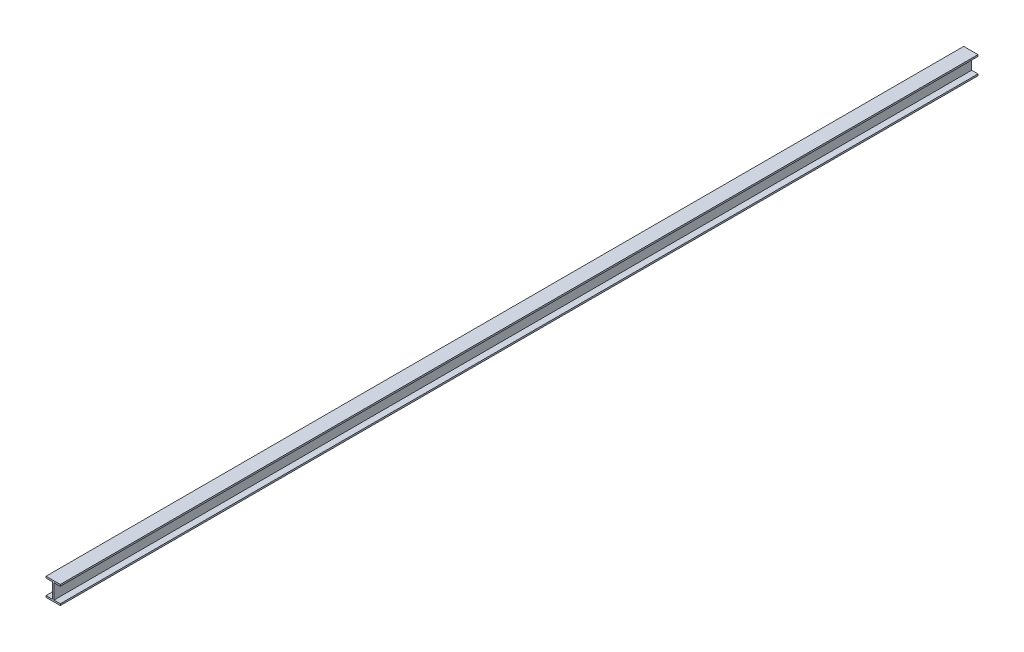
ISO-10303-21;
HEADER;
FILE_DESCRIPTION(('STEP AP214'),'2;1');
FILE_NAME('part.step','',(''),(''),'','','');
FILE_SCHEMA(('AUTOMOTIVE_DESIGN { 1 0 10303 214 1 1 1 1 }'));
ENDSEC;
DATA;
#1=APPLICATION_CONTEXT('core data for automotive mechanical design processes');
#2=APPLICATION_PROTOCOL_DEFINITION('international standard','automotive_design',2000,#1);
#3=PRODUCT_CONTEXT('',#1,'mechanical');
#4=PRODUCT('Part','Part','',(#3));
#5=PRODUCT_RELATED_PRODUCT_CATEGORY('part','',(#4));
#6=PRODUCT_DEFINITION_FORMATION('','',#4);
#7=PRODUCT_DEFINITION_CONTEXT('part definition',#1,'design');
#8=PRODUCT_DEFINITION('design','',#6,#7);
#9=PRODUCT_DEFINITION_SHAPE('','',#8);
#10=(LENGTH_UNIT() NAMED_UNIT(*) SI_UNIT(.MILLI.,.METRE.));
#11=(NAMED_UNIT(*) PLANE_ANGLE_UNIT() SI_UNIT($,.RADIAN.));
#12=(NAMED_UNIT(*) SI_UNIT($,.STERADIAN.) SOLID_ANGLE_UNIT());
#13=UNCERTAINTY_MEASURE_WITH_UNIT(LENGTH_MEASURE(1.E-05),#10,'distance_accuracy_value','');
#14=(GEOMETRIC_REPRESENTATION_CONTEXT(3) GLOBAL_UNCERTAINTY_ASSIGNED_CONTEXT((#13)) GLOBAL_UNIT_ASSIGNED_CONTEXT((#10,
#11,#12)) REPRESENTATION_CONTEXT('',''));
#15=CARTESIAN_POINT('',(0.,0.,0.));
#16=DIRECTION('',(0.,0.,1.));
#17=DIRECTION('',(1.,0.,0.));
#18=AXIS2_PLACEMENT_3D('',#15,#16,#17);
#19=CARTESIAN_POINT('',(0.,-328.,18000.));
#20=DIRECTION('',(0.,1.,0.));
#21=DIRECTION('',(0.,0.,1.));
#22=AXIS2_PLACEMENT_3D('',#19,#20,#21);
#23=PLANE('',#22);
#24=DIRECTION('',(1.,0.,0.));
#25=VECTOR('',#24,1.);
#26=CARTESIAN_POINT('',(0.,-328.,0.));
#27=LINE('',#26,#25);
#28=CARTESIAN_POINT('',(156.,-328.,0.));
#29=VERTEX_POINT('',#28);
#30=CARTESIAN_POINT('',(280.,-328.,0.));
#31=VERTEX_POINT('',#30);
#32=EDGE_CURVE('E164',#29,#31,#27,.T.);
#33=ORIENTED_EDGE('',*,*,#32,.F.);
#34=DIRECTION('',(0.,0.,-1.));
#35=VECTOR('',#34,1.);
#36=CARTESIAN_POINT('',(156.,-328.,18000.));
#37=LINE('',#36,#35);
#38=CARTESIAN_POINT('',(156.,-328.,18000.));
#39=VERTEX_POINT('',#38);
#40=EDGE_CURVE('E11',#39,#29,#37,.T.);
#41=ORIENTED_EDGE('',*,*,#40,.F.);
#42=DIRECTION('',(1.,0.,0.));
#43=VECTOR('',#42,1.);
#44=CARTESIAN_POINT('',(0.,-328.,18000.));
#45=LINE('',#44,#43);
#46=CARTESIAN_POINT('',(280.,-328.,18000.));
#47=VERTEX_POINT('',#46);
#48=EDGE_CURVE('E205',#39,#47,#45,.T.);
#49=ORIENTED_EDGE('',*,*,#48,.T.);
#50=DIRECTION('',(0.,0.,-1.));
#51=VECTOR('',#50,1.);
#52=CARTESIAN_POINT('',(280.,-328.,18000.));
#53=LINE('',#52,#51);
#54=EDGE_CURVE('E104',#47,#31,#53,.T.);
#55=ORIENTED_EDGE('',*,*,#54,.T.);
#56=EDGE_LOOP('',(#33,#41,#49,#55));
#57=FACE_BOUND('',#56,.T.);
#58=ADVANCED_FACE('F41',(#57),#23,.T.);
#59=CARTESIAN_POINT('',(156.,0.,18000.));
#60=DIRECTION('',(1.,0.,0.));
#61=DIRECTION('',(0.,1.,0.));
#62=AXIS2_PLACEMENT_3D('',#59,#60,#61);
#63=PLANE('',#62);
#64=DIRECTION('',(0.,-1.,0.));
#65=VECTOR('',#64,1.);
#66=CARTESIAN_POINT('',(156.,0.,0.));
#67=LINE('',#66,#65);
#68=CARTESIAN_POINT('',(156.,-32.,0.));
#69=VERTEX_POINT('',#68);
#70=EDGE_CURVE('E168',#69,#29,#67,.T.);
#71=ORIENTED_EDGE('',*,*,#70,.F.);
#72=DIRECTION('',(0.,0.,-1.));
#73=VECTOR('',#72,1.);
#74=CARTESIAN_POINT('',(156.,-32.,18000.));
#75=LINE('',#74,#73);
#76=CARTESIAN_POINT('',(156.,-32.,18000.));
#77=VERTEX_POINT('',#76);
#78=EDGE_CURVE('E50',#77,#69,#75,.T.);
#79=ORIENTED_EDGE('',*,*,#78,.F.);
#80=DIRECTION('',(0.,-1.,0.));
#81=VECTOR('',#80,1.);
#82=CARTESIAN_POINT('',(156.,0.,18000.));
#83=LINE('',#82,#81);
#84=EDGE_CURVE('E246',#77,#39,#83,.T.);
#85=ORIENTED_EDGE('',*,*,#84,.T.);
#86=ORIENTED_EDGE('',*,*,#40,.T.);
#87=EDGE_LOOP('',(#71,#79,#85,#86));
#88=FACE_BOUND('',#87,.T.);
#89=ADVANCED_FACE('F245',(#88),#63,.T.);
#90=CARTESIAN_POINT('',(0.,-32.,18000.));
#91=DIRECTION('',(0.,1.,0.));
#92=DIRECTION('',(-1.,0.,0.));
#93=AXIS2_PLACEMENT_3D('',#90,#91,#92);
#94=PLANE('',#93);
#95=DIRECTION('',(1.,0.,0.));
#96=VECTOR('',#95,1.);
#97=CARTESIAN_POINT('',(0.,-32.,0.));
#98=LINE('',#97,#96);
#99=CARTESIAN_POINT('',(280.,-32.,0.));
#100=VERTEX_POINT('',#99);
#101=EDGE_CURVE('E172',#69,#100,#98,.T.);
#102=ORIENTED_EDGE('',*,*,#101,.T.);
#103=DIRECTION('',(0.,0.,-1.));
#104=VECTOR('',#103,1.);
#105=CARTESIAN_POINT('',(280.,-32.,18000.));
#106=LINE('',#105,#104);
#107=CARTESIAN_POINT('',(280.,-32.,18000.));
#108=VERTEX_POINT('',#107);
#109=EDGE_CURVE('E229',#108,#100,#106,.T.);
#110=ORIENTED_EDGE('',*,*,#109,.F.);
#111=DIRECTION('',(1.,0.,0.));
#112=VECTOR('',#111,1.);
#113=CARTESIAN_POINT('',(0.,-32.,18000.));
#114=LINE('',#113,#112);
#115=EDGE_CURVE('E237',#77,#108,#114,.T.);
#116=ORIENTED_EDGE('',*,*,#115,.F.);
#117=ORIENTED_EDGE('',*,*,#78,.T.);
#118=EDGE_LOOP('',(#102,#110,#116,#117));
#119=FACE_BOUND('',#118,.T.);
#120=ADVANCED_FACE('F235',(#119),#94,.F.);
#121=CARTESIAN_POINT('',(280.,0.,18000.));
#122=DIRECTION('',(1.,0.,0.));
#123=DIRECTION('',(0.,0.,-1.));
#124=AXIS2_PLACEMENT_3D('',#121,#122,#123);
#125=PLANE('',#124);
#126=DIRECTION('',(0.,-1.,0.));
#127=VECTOR('',#126,1.);
#128=CARTESIAN_POINT('',(280.,0.,0.));
#129=LINE('',#128,#127);
#130=CARTESIAN_POINT('',(280.,0.,0.));
#131=VERTEX_POINT('',#130);
#132=EDGE_CURVE('E176',#131,#100,#129,.T.);
#133=ORIENTED_EDGE('',*,*,#132,.F.);
#134=DIRECTION('',(0.,0.,-1.));
#135=VECTOR('',#134,1.);
#136=CARTESIAN_POINT('',(280.,0.,18000.));
#137=LINE('',#136,#135);
#138=CARTESIAN_POINT('',(280.,0.,18000.));
#139=VERTEX_POINT('',#138);
#140=EDGE_CURVE('E226',#139,#131,#137,.T.);
#141=ORIENTED_EDGE('',*,*,#140,.F.);
#142=DIRECTION('',(0.,-1.,0.));
#143=VECTOR('',#142,1.);
#144=CARTESIAN_POINT('',(280.,0.,18000.));
#145=LINE('',#144,#143);
#146=EDGE_CURVE('E257',#139,#108,#145,.T.);
#147=ORIENTED_EDGE('',*,*,#146,.T.);
#148=ORIENTED_EDGE('',*,*,#109,.T.);
#149=EDGE_LOOP('',(#133,#141,#147,#148));
#150=FACE_BOUND('',#149,.T.);
#151=ADVANCED_FACE('F295',(#150),#125,.T.);
#152=CARTESIAN_POINT('',(0.,0.,18000.));
#153=DIRECTION('',(0.,1.,0.));
#154=DIRECTION('',(0.,0.,1.));
#155=AXIS2_PLACEMENT_3D('',#152,#153,#154);
#156=PLANE('',#155);
#157=DIRECTION('',(1.,0.,0.));
#158=VECTOR('',#157,1.);
#159=CARTESIAN_POINT('',(0.,0.,0.));
#160=LINE('',#159,#158);
#161=CARTESIAN_POINT('',(0.,0.,0.));
#162=VERTEX_POINT('',#161);
#163=EDGE_CURVE('E180',#162,#131,#160,.T.);
#164=ORIENTED_EDGE('',*,*,#163,.F.);
#165=DIRECTION('',(0.,0.,-1.));
#166=VECTOR('',#165,1.);
#167=CARTESIAN_POINT('',(0.,0.,18000.));
#168=LINE('',#167,#166);
#169=CARTESIAN_POINT('',(0.,0.,18000.));
#170=VERTEX_POINT('',#169);
#171=EDGE_CURVE('E223',#170,#162,#168,.T.);
#172=ORIENTED_EDGE('',*,*,#171,.F.);
#173=DIRECTION('',(1.,0.,0.));
#174=VECTOR('',#173,1.);
#175=CARTESIAN_POINT('',(0.,0.,18000.));
#176=LINE('',#175,#174);
#177=EDGE_CURVE('E261',#170,#139,#176,.T.);
#178=ORIENTED_EDGE('',*,*,#177,.T.);
#179=ORIENTED_EDGE('',*,*,#140,.T.);
#180=EDGE_LOOP('',(#164,#172,#178,#179));
#181=FACE_BOUND('',#180,.T.);
#182=ADVANCED_FACE('F292',(#181),#156,.T.);
#183=CARTESIAN_POINT('',(0.,0.,18000.));
#184=DIRECTION('',(1.,0.,0.));
#185=DIRECTION('',(0.,1.,0.));
#186=AXIS2_PLACEMENT_3D('',#183,#184,#185);
#187=PLANE('',#186);
#188=DIRECTION('',(0.,-1.,0.));
#189=VECTOR('',#188,1.);
#190=CARTESIAN_POINT('',(0.,0.,0.));
#191=LINE('',#190,#189);
#192=CARTESIAN_POINT('',(0.,-32.,0.));
#193=VERTEX_POINT('',#192);
#194=EDGE_CURVE('E184',#162,#193,#191,.T.);
#195=ORIENTED_EDGE('',*,*,#194,.T.);
#196=DIRECTION('',(0.,0.,-1.));
#197=VECTOR('',#196,1.);
#198=CARTESIAN_POINT('',(0.,-32.,18000.));
#199=LINE('',#198,#197);
#200=CARTESIAN_POINT('',(0.,-32.,18000.));
#201=VERTEX_POINT('',#200);
#202=EDGE_CURVE('E219',#201,#193,#199,.T.);
#203=ORIENTED_EDGE('',*,*,#202,.F.);
#204=DIRECTION('',(0.,-1.,0.));
#205=VECTOR('',#204,1.);
#206=CARTESIAN_POINT('',(0.,0.,18000.));
#207=LINE('',#206,#205);
#208=EDGE_CURVE('E265',#170,#201,#207,.T.);
#209=ORIENTED_EDGE('',*,*,#208,.F.);
#210=ORIENTED_EDGE('',*,*,#171,.T.);
#211=EDGE_LOOP('',(#195,#203,#209,#210));
#212=FACE_BOUND('',#211,.T.);
#213=ADVANCED_FACE('F289',(#212),#187,.F.);
#214=CARTESIAN_POINT('',(0.,-32.,18000.));
#215=DIRECTION('',(0.,1.,0.));
#216=DIRECTION('',(-1.,0.,0.));
#217=AXIS2_PLACEMENT_3D('',#214,#215,#216);
#218=PLANE('',#217);
#219=DIRECTION('',(1.,0.,0.));
#220=VECTOR('',#219,1.);
#221=CARTESIAN_POINT('',(0.,-32.,0.));
#222=LINE('',#221,#220);
#223=CARTESIAN_POINT('',(124.,-32.,0.));
#224=VERTEX_POINT('',#223);
#225=EDGE_CURVE('E187',#193,#224,#222,.T.);
#226=ORIENTED_EDGE('',*,*,#225,.T.);
#227=DIRECTION('',(0.,0.,-1.));
#228=VECTOR('',#227,1.);
#229=CARTESIAN_POINT('',(124.,-32.,18000.));
#230=LINE('',#229,#228);
#231=CARTESIAN_POINT('',(124.,-32.,18000.));
#232=VERTEX_POINT('',#231);
#233=EDGE_CURVE('E215',#232,#224,#230,.T.);
#234=ORIENTED_EDGE('',*,*,#233,.F.);
#235=DIRECTION('',(1.,0.,0.));
#236=VECTOR('',#235,1.);
#237=CARTESIAN_POINT('',(0.,-32.,18000.));
#238=LINE('',#237,#236);
#239=EDGE_CURVE('E268',#201,#232,#238,.T.);
#240=ORIENTED_EDGE('',*,*,#239,.F.);
#241=ORIENTED_EDGE('',*,*,#202,.T.);
#242=EDGE_LOOP('',(#226,#234,#240,#241));
#243=FACE_BOUND('',#242,.T.);
#244=ADVANCED_FACE('F285',(#243),#218,.F.);
#245=CARTESIAN_POINT('',(124.,0.,18000.));
#246=DIRECTION('',(1.,0.,0.));
#247=DIRECTION('',(0.,1.,0.));
#248=AXIS2_PLACEMENT_3D('',#245,#246,#247);
#249=PLANE('',#248);
#250=DIRECTION('',(0.,-1.,0.));
#251=VECTOR('',#250,1.);
#252=CARTESIAN_POINT('',(124.,0.,0.));
#253=LINE('',#252,#251);
#254=CARTESIAN_POINT('',(124.,-328.,0.));
#255=VERTEX_POINT('',#254);
#256=EDGE_CURVE('E190',#224,#255,#253,.T.);
#257=ORIENTED_EDGE('',*,*,#256,.T.);
#258=DIRECTION('',(0.,0.,-1.));
#259=VECTOR('',#258,1.);
#260=CARTESIAN_POINT('',(124.,-328.,18000.));
#261=LINE('',#260,#259);
#262=CARTESIAN_POINT('',(124.,-328.,18000.));
#263=VERTEX_POINT('',#262);
#264=EDGE_CURVE('E212',#263,#255,#261,.T.);
#265=ORIENTED_EDGE('',*,*,#264,.F.);
#266=DIRECTION('',(0.,-1.,0.));
#267=VECTOR('',#266,1.);
#268=CARTESIAN_POINT('',(124.,0.,18000.));
#269=LINE('',#268,#267);
#270=EDGE_CURVE('E158',#232,#263,#269,.T.);
#271=ORIENTED_EDGE('',*,*,#270,.F.);
#272=ORIENTED_EDGE('',*,*,#233,.T.);
#273=EDGE_LOOP('',(#257,#265,#271,#272));
#274=FACE_BOUND('',#273,.T.);
#275=ADVANCED_FACE('F276',(#274),#249,.F.);
#276=CARTESIAN_POINT('',(0.,-328.,18000.));
#277=DIRECTION('',(0.,1.,0.));
#278=DIRECTION('',(0.,0.,1.));
#279=AXIS2_PLACEMENT_3D('',#276,#277,#278);
#280=PLANE('',#279);
#281=DIRECTION('',(1.,0.,0.));
#282=VECTOR('',#281,1.);
#283=CARTESIAN_POINT('',(0.,-328.,0.));
#284=LINE('',#283,#282);
#285=CARTESIAN_POINT('',(0.,-328.,0.));
#286=VERTEX_POINT('',#285);
#287=EDGE_CURVE('E194',#286,#255,#284,.T.);
#288=ORIENTED_EDGE('',*,*,#287,.F.);
#289=DIRECTION('',(0.,0.,-1.));
#290=VECTOR('',#289,1.);
#291=CARTESIAN_POINT('',(0.,-328.,18000.));
#292=LINE('',#291,#290);
#293=CARTESIAN_POINT('',(0.,-328.,18000.));
#294=VERTEX_POINT('',#293);
#295=EDGE_CURVE('E144',#294,#286,#292,.T.);
#296=ORIENTED_EDGE('',*,*,#295,.F.);
#297=DIRECTION('',(1.,0.,0.));
#298=VECTOR('',#297,1.);
#299=CARTESIAN_POINT('',(0.,-328.,18000.));
#300=LINE('',#299,#298);
#301=EDGE_CURVE('E154',#294,#263,#300,.T.);
#302=ORIENTED_EDGE('',*,*,#301,.T.);
#303=ORIENTED_EDGE('',*,*,#264,.T.);
#304=EDGE_LOOP('',(#288,#296,#302,#303));
#305=FACE_BOUND('',#304,.T.);
#306=ADVANCED_FACE('F280',(#305),#280,.T.);
#307=CARTESIAN_POINT('',(0.,0.,18000.));
#308=DIRECTION('',(-1.,0.,0.));
#309=DIRECTION('',(0.,0.,1.));
#310=AXIS2_PLACEMENT_3D('',#307,#308,#309);
#311=PLANE('',#310);
#312=DIRECTION('',(0.,1.,0.));
#313=VECTOR('',#312,1.);
#314=CARTESIAN_POINT('',(0.,0.,0.));
#315=LINE('',#314,#313);
#316=CARTESIAN_POINT('',(0.,-360.,0.));
#317=VERTEX_POINT('',#316);
#318=EDGE_CURVE('E142',#317,#286,#315,.T.);
#319=ORIENTED_EDGE('',*,*,#318,.F.);
#320=DIRECTION('',(0.,0.,-1.));
#321=VECTOR('',#320,1.);
#322=CARTESIAN_POINT('',(0.,-360.,18000.));
#323=LINE('',#322,#321);
#324=CARTESIAN_POINT('',(0.,-360.,18000.));
#325=VERTEX_POINT('',#324);
#326=EDGE_CURVE('E136',#325,#317,#323,.T.);
#327=ORIENTED_EDGE('',*,*,#326,.F.);
#328=DIRECTION('',(0.,1.,0.));
#329=VECTOR('',#328,1.);
#330=CARTESIAN_POINT('',(0.,0.,18000.));
#331=LINE('',#330,#329);
#332=EDGE_CURVE('E140',#325,#294,#331,.T.);
#333=ORIENTED_EDGE('',*,*,#332,.T.);
#334=ORIENTED_EDGE('',*,*,#295,.T.);
#335=EDGE_LOOP('',(#319,#327,#333,#334));
#336=FACE_BOUND('',#335,.T.);
#337=ADVANCED_FACE('F138',(#336),#311,.T.);
#338=CARTESIAN_POINT('',(0.,-360.,18000.));
#339=DIRECTION('',(0.,1.,0.));
#340=DIRECTION('',(0.,0.,1.));
#341=AXIS2_PLACEMENT_3D('',#338,#339,#340);
#342=PLANE('',#341);
#343=DIRECTION('',(1.,0.,0.));
#344=VECTOR('',#343,1.);
#345=CARTESIAN_POINT('',(0.,-360.,0.));
#346=LINE('',#345,#344);
#347=CARTESIAN_POINT('',(280.,-360.,0.));
#348=VERTEX_POINT('',#347);
#349=EDGE_CURVE('E97',#317,#348,#346,.T.);
#350=ORIENTED_EDGE('',*,*,#349,.T.);
#351=DIRECTION('',(0.,0.,-1.));
#352=VECTOR('',#351,1.);
#353=CARTESIAN_POINT('',(280.,-360.,18000.));
#354=LINE('',#353,#352);
#355=CARTESIAN_POINT('',(280.,-360.,18000.));
#356=VERTEX_POINT('',#355);
#357=EDGE_CURVE('E145',#356,#348,#354,.T.);
#358=ORIENTED_EDGE('',*,*,#357,.F.);
#359=DIRECTION('',(1.,0.,0.));
#360=VECTOR('',#359,1.);
#361=CARTESIAN_POINT('',(0.,-360.,18000.));
#362=LINE('',#361,#360);
#363=EDGE_CURVE('E147',#325,#356,#362,.T.);
#364=ORIENTED_EDGE('',*,*,#363,.F.);
#365=ORIENTED_EDGE('',*,*,#326,.T.);
#366=EDGE_LOOP('',(#350,#358,#364,#365));
#367=FACE_BOUND('',#366,.T.);
#368=ADVANCED_FACE('F148',(#367),#342,.F.);
#369=CARTESIAN_POINT('',(280.,0.,18000.));
#370=DIRECTION('',(-1.,0.,0.));
#371=DIRECTION('',(0.,0.,1.));
#372=AXIS2_PLACEMENT_3D('',#369,#370,#371);
#373=PLANE('',#372);
#374=DIRECTION('',(0.,1.,0.));
#375=VECTOR('',#374,1.);
#376=CARTESIAN_POINT('',(280.,0.,0.));
#377=LINE('',#376,#375);
#378=EDGE_CURVE('E202',#348,#31,#377,.T.);
#379=ORIENTED_EDGE('',*,*,#378,.T.);
#380=ORIENTED_EDGE('',*,*,#54,.F.);
#381=DIRECTION('',(0.,1.,0.));
#382=VECTOR('',#381,1.);
#383=CARTESIAN_POINT('',(280.,0.,18000.));
#384=LINE('',#383,#382);
#385=EDGE_CURVE('E58',#356,#47,#384,.T.);
#386=ORIENTED_EDGE('',*,*,#385,.F.);
#387=ORIENTED_EDGE('',*,*,#357,.T.);
#388=EDGE_LOOP('',(#379,#380,#386,#387));
#389=FACE_BOUND('',#388,.T.);
#390=ADVANCED_FACE('F249',(#389),#373,.F.);
#391=CARTESIAN_POINT('',(0.,0.,18000.));
#392=DIRECTION('',(0.,0.,1.));
#393=DIRECTION('',(1.,0.,0.));
#394=AXIS2_PLACEMENT_3D('',#391,#392,#393);
#395=PLANE('',#394);
#396=ORIENTED_EDGE('',*,*,#48,.F.);
#397=ORIENTED_EDGE('',*,*,#84,.F.);
#398=ORIENTED_EDGE('',*,*,#115,.T.);
#399=ORIENTED_EDGE('',*,*,#146,.F.);
#400=ORIENTED_EDGE('',*,*,#177,.F.);
#401=ORIENTED_EDGE('',*,*,#208,.T.);
#402=ORIENTED_EDGE('',*,*,#239,.T.);
#403=ORIENTED_EDGE('',*,*,#270,.T.);
#404=ORIENTED_EDGE('',*,*,#301,.F.);
#405=ORIENTED_EDGE('',*,*,#332,.F.);
#406=ORIENTED_EDGE('',*,*,#363,.T.);
#407=ORIENTED_EDGE('',*,*,#385,.T.);
#408=EDGE_LOOP('',(#396,#397,#398,#399,#400,#401,#402,#403,#404,#405,#406,#407));
#409=FACE_BOUND('',#408,.T.);
#410=ADVANCED_FACE('F152',(#409),#395,.T.);
#411=CARTESIAN_POINT('',(0.,0.,0.));
#412=DIRECTION('',(0.,0.,1.));
#413=DIRECTION('',(1.,0.,0.));
#414=AXIS2_PLACEMENT_3D('',#411,#412,#413);
#415=PLANE('',#414);
#416=ORIENTED_EDGE('',*,*,#32,.T.);
#417=ORIENTED_EDGE('',*,*,#378,.F.);
#418=ORIENTED_EDGE('',*,*,#349,.F.);
#419=ORIENTED_EDGE('',*,*,#318,.T.);
#420=ORIENTED_EDGE('',*,*,#287,.T.);
#421=ORIENTED_EDGE('',*,*,#256,.F.);
#422=ORIENTED_EDGE('',*,*,#225,.F.);
#423=ORIENTED_EDGE('',*,*,#194,.F.);
#424=ORIENTED_EDGE('',*,*,#163,.T.);
#425=ORIENTED_EDGE('',*,*,#132,.T.);
#426=ORIENTED_EDGE('',*,*,#101,.F.);
#427=ORIENTED_EDGE('',*,*,#70,.T.);
#428=EDGE_LOOP('',(#416,#417,#418,#419,#420,#421,#422,#423,#424,#425,#426,#427));
#429=FACE_BOUND('',#428,.T.);
#430=ADVANCED_FACE('F243',(#429),#415,.F.);
#431=CLOSED_SHELL('',(#58,#89,#120,#151,#182,#213,#244,#275,#306,#337,#368,#390,#410,#430));
#432=MANIFOLD_SOLID_BREP('B2',#431);
#433=ADVANCED_BREP_SHAPE_REPRESENTATION('',(#18,#432),#14);
#434=SHAPE_DEFINITION_REPRESENTATION(#9,#433);
ENDSEC;
END-ISO-10303-21;
